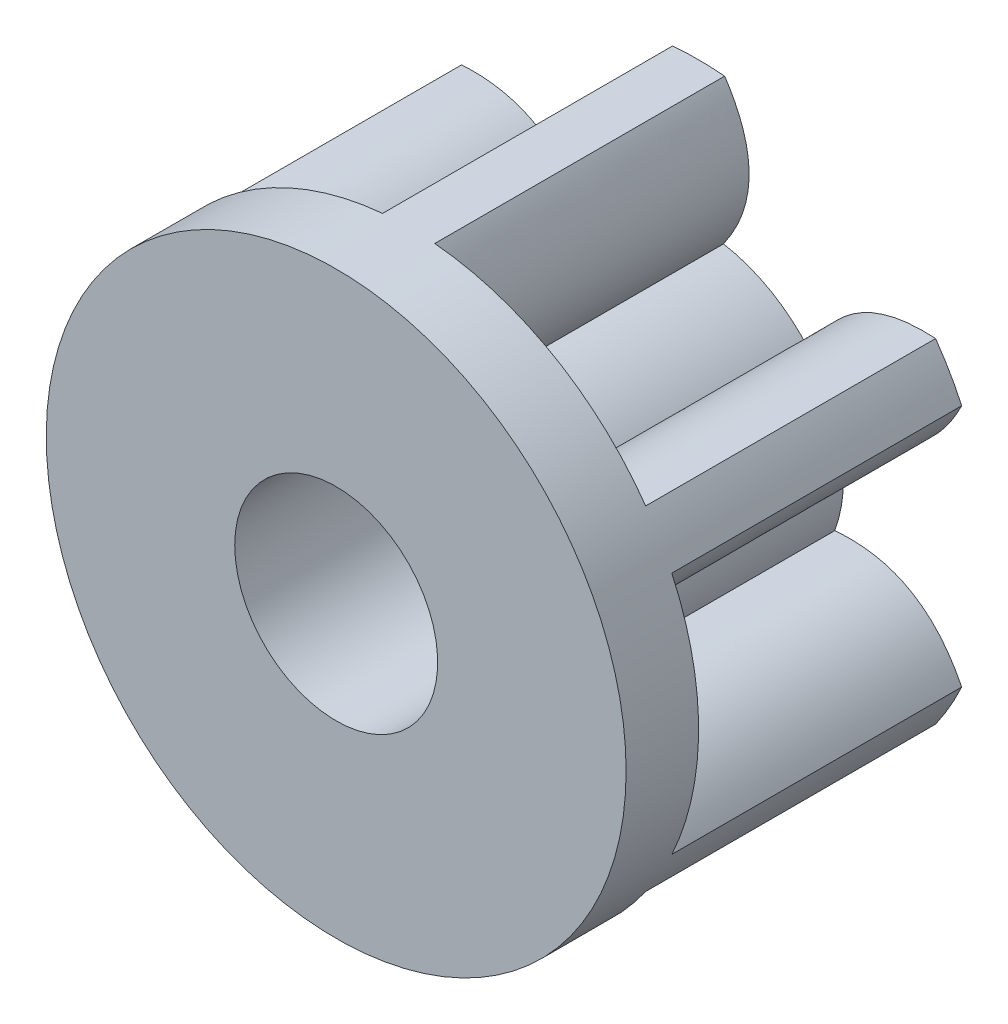
ISO-10303-21;
HEADER;
FILE_DESCRIPTION(('STEP AP214'),'2;1');
FILE_NAME('part.step','',(''),(''),'','','');
FILE_SCHEMA(('AUTOMOTIVE_DESIGN { 1 0 10303 214 1 1 1 1 }'));
ENDSEC;
DATA;
#1=APPLICATION_CONTEXT('core data for automotive mechanical design processes');
#2=APPLICATION_PROTOCOL_DEFINITION('international standard','automotive_design',2000,#1);
#3=PRODUCT_CONTEXT('',#1,'mechanical');
#4=PRODUCT('Part','Part','',(#3));
#5=PRODUCT_RELATED_PRODUCT_CATEGORY('part','',(#4));
#6=PRODUCT_DEFINITION_FORMATION('','',#4);
#7=PRODUCT_DEFINITION_CONTEXT('part definition',#1,'design');
#8=PRODUCT_DEFINITION('design','',#6,#7);
#9=PRODUCT_DEFINITION_SHAPE('','',#8);
#10=(LENGTH_UNIT() NAMED_UNIT(*) SI_UNIT(.MILLI.,.METRE.));
#11=(NAMED_UNIT(*) PLANE_ANGLE_UNIT() SI_UNIT($,.RADIAN.));
#12=(NAMED_UNIT(*) SI_UNIT($,.STERADIAN.) SOLID_ANGLE_UNIT());
#13=UNCERTAINTY_MEASURE_WITH_UNIT(LENGTH_MEASURE(1.E-05),#10,'distance_accuracy_value','');
#14=(GEOMETRIC_REPRESENTATION_CONTEXT(3) GLOBAL_UNCERTAINTY_ASSIGNED_CONTEXT((#13)) GLOBAL_UNIT_ASSIGNED_CONTEXT((#10,
#11,#12)) REPRESENTATION_CONTEXT('',''));
#15=CARTESIAN_POINT('',(0.,0.,0.));
#16=DIRECTION('',(0.,0.,1.));
#17=DIRECTION('',(1.,0.,0.));
#18=AXIS2_PLACEMENT_3D('',#15,#16,#17);
#19=CARTESIAN_POINT('',(1.63502173899346,1.15182633804702,2.));
#20=CARTESIAN_POINT('',(1.02107881373067,1.1908820937182,2.));
#21=CARTESIAN_POINT('',(0.767507810570378,0.641039593717475,2.));
#22=B_SPLINE_CURVE_WITH_KNOTS('',2,(#19,#20,#21),.UNSPECIFIED.,.F.,.F.,(3,3),(0.,1.),.UNSPECIFIED.);
#23=DIRECTION('',(0.,0.,-1.));
#24=VECTOR('',#23,1.);
#25=SURFACE_OF_LINEAR_EXTRUSION('',#22,#24);
#26=CARTESIAN_POINT('',(1.63502173899346,1.15182633804702,0.));
#27=CARTESIAN_POINT('',(1.02107881373067,1.1908820937182,0.));
#28=CARTESIAN_POINT('',(0.767507810570378,0.641039593717475,0.));
#29=B_SPLINE_CURVE_WITH_KNOTS('',2,(#26,#27,#28),.UNSPECIFIED.,.F.,.F.,(3,3),(0.,1.),.UNSPECIFIED.);
#30=CARTESIAN_POINT('',(1.63502173899346,1.15182633804702,0.));
#31=VERTEX_POINT('',#30);
#32=CARTESIAN_POINT('',(0.767507810570378,0.641039593717475,0.));
#33=VERTEX_POINT('',#32);
#34=EDGE_CURVE('E361',#31,#33,#29,.T.);
#35=ORIENTED_EDGE('',*,*,#34,.T.);
#36=DIRECTION('',(0.,0.,-1.));
#37=VECTOR('',#36,1.);
#38=CARTESIAN_POINT('',(0.767507810570378,0.641039593717475,2.));
#39=LINE('',#38,#37);
#40=CARTESIAN_POINT('',(0.767507810570378,0.641039593717475,2.));
#41=VERTEX_POINT('',#40);
#42=EDGE_CURVE('E11',#41,#33,#39,.T.);
#43=ORIENTED_EDGE('',*,*,#42,.F.);
#44=CARTESIAN_POINT('',(1.63502173899346,1.15182633804702,2.));
#45=VERTEX_POINT('',#44);
#46=EDGE_CURVE('E454',#45,#41,#22,.T.);
#47=ORIENTED_EDGE('',*,*,#46,.F.);
#48=DIRECTION('',(0.,0.,-1.));
#49=VECTOR('',#48,1.);
#50=CARTESIAN_POINT('',(1.63502173899346,1.15182633804702,2.));
#51=LINE('',#50,#49);
#52=EDGE_CURVE('E51',#45,#31,#51,.T.);
#53=ORIENTED_EDGE('',*,*,#52,.T.);
#54=EDGE_LOOP('',(#35,#43,#47,#53));
#55=FACE_BOUND('',#54,.T.);
#56=ADVANCED_FACE('F34',(#55),#25,.F.);
#57=CARTESIAN_POINT('',(0.,0.,2.));
#58=DIRECTION('',(0.,0.,-1.));
#59=DIRECTION('',(-1.,0.,0.));
#60=AXIS2_PLACEMENT_3D('',#57,#58,#59);
#61=CYLINDRICAL_SURFACE('',#60,1.);
#62=CARTESIAN_POINT('',(0.,0.,0.));
#63=DIRECTION('',(0.,0.,1.));
#64=DIRECTION('',(1.,0.,0.));
#65=AXIS2_PLACEMENT_3D('',#62,#63,#64);
#66=CIRCLE('',#65,1.);
#67=CARTESIAN_POINT('',(0.171402667705802,0.985201058415659,0.));
#68=VERTEX_POINT('',#67);
#69=EDGE_CURVE('E355',#33,#68,#66,.T.);
#70=ORIENTED_EDGE('',*,*,#69,.T.);
#71=DIRECTION('',(0.,0.,-1.));
#72=VECTOR('',#71,1.);
#73=CARTESIAN_POINT('',(0.171402667705802,0.985201058415659,2.));
#74=LINE('',#73,#72);
#75=CARTESIAN_POINT('',(0.171402667705802,0.985201058415659,2.));
#76=VERTEX_POINT('',#75);
#77=EDGE_CURVE('E43',#76,#68,#74,.T.);
#78=ORIENTED_EDGE('',*,*,#77,.F.);
#79=CARTESIAN_POINT('',(0.,0.,2.));
#80=DIRECTION('',(0.,0.,1.));
#81=DIRECTION('',(1.,0.,0.));
#82=AXIS2_PLACEMENT_3D('',#79,#80,#81);
#83=CIRCLE('',#82,1.);
#84=EDGE_CURVE('E141',#41,#76,#83,.T.);
#85=ORIENTED_EDGE('',*,*,#84,.F.);
#86=ORIENTED_EDGE('',*,*,#42,.T.);
#87=EDGE_LOOP('',(#70,#78,#85,#86));
#88=FACE_BOUND('',#87,.T.);
#89=ADVANCED_FACE('F501',(#88),#61,.T.);
#90=CARTESIAN_POINT('',(0.171402667705802,0.985201058415659,2.));
#91=CARTESIAN_POINT('',(0.520879983891172,1.47977723148367,2.));
#92=CARTESIAN_POINT('',(0.179817657642402,1.9919,2.));
#93=B_SPLINE_CURVE_WITH_KNOTS('',2,(#90,#91,#92),.UNSPECIFIED.,.F.,.F.,(3,3),(0.,1.),.UNSPECIFIED.);
#94=DIRECTION('',(0.,0.,-1.));
#95=VECTOR('',#94,1.);
#96=SURFACE_OF_LINEAR_EXTRUSION('',#93,#95);
#97=CARTESIAN_POINT('',(0.171402667705802,0.985201058415659,0.));
#98=CARTESIAN_POINT('',(0.520879983891172,1.47977723148367,0.));
#99=CARTESIAN_POINT('',(0.179817657642402,1.9919,0.));
#100=B_SPLINE_CURVE_WITH_KNOTS('',2,(#97,#98,#99),.UNSPECIFIED.,.F.,.F.,(3,3),(0.,1.),.UNSPECIFIED.);
#101=CARTESIAN_POINT('',(0.179817657642402,1.9919,0.));
#102=VERTEX_POINT('',#101);
#103=EDGE_CURVE('E348',#68,#102,#100,.T.);
#104=ORIENTED_EDGE('',*,*,#103,.T.);
#105=DIRECTION('',(0.,0.,-1.));
#106=VECTOR('',#105,1.);
#107=CARTESIAN_POINT('',(0.179817657642402,1.9919,2.));
#108=LINE('',#107,#106);
#109=CARTESIAN_POINT('',(0.179817657642402,1.9919,2.));
#110=VERTEX_POINT('',#109);
#111=EDGE_CURVE('E341',#110,#102,#108,.T.);
#112=ORIENTED_EDGE('',*,*,#111,.F.);
#113=EDGE_CURVE('E350',#76,#110,#93,.T.);
#114=ORIENTED_EDGE('',*,*,#113,.F.);
#115=ORIENTED_EDGE('',*,*,#77,.T.);
#116=EDGE_LOOP('',(#104,#112,#114,#115));
#117=FACE_BOUND('',#116,.T.);
#118=ADVANCED_FACE('F347',(#117),#96,.F.);
#119=CARTESIAN_POINT('',(-0.18,1.99188353073165,2.));
#120=CARTESIAN_POINT('',(-0.520794739206634,1.47972123881594,2.));
#121=CARTESIAN_POINT('',(-0.171402667705803,0.985201058415659,2.));
#122=B_SPLINE_CURVE_WITH_KNOTS('',2,(#119,#120,#121),.UNSPECIFIED.,.F.,.F.,(3,3),(0.,1.),.UNSPECIFIED.);
#123=DIRECTION('',(0.,0.,-1.));
#124=VECTOR('',#123,1.);
#125=SURFACE_OF_LINEAR_EXTRUSION('',#122,#124);
#126=CARTESIAN_POINT('',(-0.18,1.99188353073165,0.));
#127=CARTESIAN_POINT('',(-0.520794739206634,1.47972123881594,0.));
#128=CARTESIAN_POINT('',(-0.171402667705803,0.985201058415659,0.));
#129=B_SPLINE_CURVE_WITH_KNOTS('',2,(#126,#127,#128),.UNSPECIFIED.,.F.,.F.,(3,3),(0.,1.),.UNSPECIFIED.);
#130=CARTESIAN_POINT('',(-0.18,1.99188353073165,0.));
#131=VERTEX_POINT('',#130);
#132=CARTESIAN_POINT('',(-0.171402667705803,0.985201058415659,0.));
#133=VERTEX_POINT('',#132);
#134=EDGE_CURVE('E359',#131,#133,#129,.T.);
#135=ORIENTED_EDGE('',*,*,#134,.T.);
#136=DIRECTION('',(0.,0.,-1.));
#137=VECTOR('',#136,1.);
#138=CARTESIAN_POINT('',(-0.171402667705803,0.985201058415659,2.));
#139=LINE('',#138,#137);
#140=CARTESIAN_POINT('',(-0.171402667705803,0.985201058415659,2.));
#141=VERTEX_POINT('',#140);
#142=EDGE_CURVE('E335',#141,#133,#139,.T.);
#143=ORIENTED_EDGE('',*,*,#142,.F.);
#144=CARTESIAN_POINT('',(-0.18,1.99188353073165,2.));
#145=VERTEX_POINT('',#144);
#146=EDGE_CURVE('E518',#145,#141,#122,.T.);
#147=ORIENTED_EDGE('',*,*,#146,.F.);
#148=DIRECTION('',(0.,0.,-1.));
#149=VECTOR('',#148,1.);
#150=CARTESIAN_POINT('',(-0.18,1.99188353073165,2.));
#151=LINE('',#150,#149);
#152=EDGE_CURVE('E338',#145,#131,#151,.T.);
#153=ORIENTED_EDGE('',*,*,#152,.T.);
#154=EDGE_LOOP('',(#135,#143,#147,#153));
#155=FACE_BOUND('',#154,.T.);
#156=ADVANCED_FACE('F508',(#155),#125,.F.);
#157=CARTESIAN_POINT('',(0.,0.,2.));
#158=DIRECTION('',(0.,0.,-1.));
#159=DIRECTION('',(-1.,0.,0.));
#160=AXIS2_PLACEMENT_3D('',#157,#158,#159);
#161=CYLINDRICAL_SURFACE('',#160,1.);
#162=CARTESIAN_POINT('',(0.,0.,0.));
#163=DIRECTION('',(0.,0.,1.));
#164=DIRECTION('',(1.,0.,0.));
#165=AXIS2_PLACEMENT_3D('',#162,#163,#164);
#166=CIRCLE('',#165,1.);
#167=CARTESIAN_POINT('',(-0.767507810570369,0.641039593717486,0.));
#168=VERTEX_POINT('',#167);
#169=EDGE_CURVE('E373',#133,#168,#166,.T.);
#170=ORIENTED_EDGE('',*,*,#169,.T.);
#171=DIRECTION('',(0.,0.,-1.));
#172=VECTOR('',#171,1.);
#173=CARTESIAN_POINT('',(-0.767507810570369,0.641039593717486,2.));
#174=LINE('',#173,#172);
#175=CARTESIAN_POINT('',(-0.767507810570369,0.641039593717486,2.));
#176=VERTEX_POINT('',#175);
#177=EDGE_CURVE('E332',#176,#168,#174,.T.);
#178=ORIENTED_EDGE('',*,*,#177,.F.);
#179=CARTESIAN_POINT('',(0.,0.,2.));
#180=DIRECTION('',(0.,0.,1.));
#181=DIRECTION('',(1.,0.,0.));
#182=AXIS2_PLACEMENT_3D('',#179,#180,#181);
#183=CIRCLE('',#182,1.);
#184=EDGE_CURVE('E527',#141,#176,#183,.T.);
#185=ORIENTED_EDGE('',*,*,#184,.F.);
#186=ORIENTED_EDGE('',*,*,#142,.T.);
#187=EDGE_LOOP('',(#170,#178,#185,#186));
#188=FACE_BOUND('',#187,.T.);
#189=ADVANCED_FACE('F552',(#188),#161,.T.);
#190=CARTESIAN_POINT('',(-0.767507810570369,0.641039593717486,2.));
#191=CARTESIAN_POINT('',(-1.02108468246106,1.19098391411443,2.));
#192=CARTESIAN_POINT('',(-1.63512717297701,1.15167665956735,2.));
#193=B_SPLINE_CURVE_WITH_KNOTS('',2,(#190,#191,#192),.UNSPECIFIED.,.F.,.F.,(3,3),(0.,1.),.UNSPECIFIED.);
#194=DIRECTION('',(0.,0.,-1.));
#195=VECTOR('',#194,1.);
#196=SURFACE_OF_LINEAR_EXTRUSION('',#193,#195);
#197=CARTESIAN_POINT('',(-0.767507810570369,0.641039593717486,0.));
#198=CARTESIAN_POINT('',(-1.02108468246106,1.19098391411443,0.));
#199=CARTESIAN_POINT('',(-1.63512717297701,1.15167665956735,0.));
#200=B_SPLINE_CURVE_WITH_KNOTS('',2,(#197,#198,#199),.UNSPECIFIED.,.F.,.F.,(3,3),(0.,1.),.UNSPECIFIED.);
#201=CARTESIAN_POINT('',(-1.63512717297701,1.15167665956735,0.));
#202=VERTEX_POINT('',#201);
#203=EDGE_CURVE('E378',#168,#202,#200,.T.);
#204=ORIENTED_EDGE('',*,*,#203,.T.);
#205=DIRECTION('',(0.,0.,-1.));
#206=VECTOR('',#205,1.);
#207=CARTESIAN_POINT('',(-1.63512717297701,1.15167665956735,2.));
#208=LINE('',#207,#206);
#209=CARTESIAN_POINT('',(-1.63512717297701,1.15167665956735,2.));
#210=VERTEX_POINT('',#209);
#211=EDGE_CURVE('E329',#210,#202,#208,.T.);
#212=ORIENTED_EDGE('',*,*,#211,.F.);
#213=EDGE_CURVE('E533',#176,#210,#193,.T.);
#214=ORIENTED_EDGE('',*,*,#213,.F.);
#215=ORIENTED_EDGE('',*,*,#177,.T.);
#216=EDGE_LOOP('',(#204,#212,#214,#215));
#217=FACE_BOUND('',#216,.T.);
#218=ADVANCED_FACE('F548',(#217),#196,.F.);
#219=CARTESIAN_POINT('',(-1.81502173899344,0.840057192684649,2.));
#220=CARTESIAN_POINT('',(-1.5418735529373,0.28883914509775,2.));
#221=CARTESIAN_POINT('',(-0.938910478276174,0.344161464698193,2.));
#222=B_SPLINE_CURVE_WITH_KNOTS('',2,(#219,#220,#221),.UNSPECIFIED.,.F.,.F.,(3,3),(0.,1.),.UNSPECIFIED.);
#223=DIRECTION('',(0.,0.,-1.));
#224=VECTOR('',#223,1.);
#225=SURFACE_OF_LINEAR_EXTRUSION('',#222,#224);
#226=CARTESIAN_POINT('',(-1.81502173899344,0.840057192684649,0.));
#227=CARTESIAN_POINT('',(-1.5418735529373,0.28883914509775,0.));
#228=CARTESIAN_POINT('',(-0.938910478276174,0.344161464698193,0.));
#229=B_SPLINE_CURVE_WITH_KNOTS('',2,(#226,#227,#228),.UNSPECIFIED.,.F.,.F.,(3,3),(0.,1.),.UNSPECIFIED.);
#230=CARTESIAN_POINT('',(-1.81502173899344,0.840057192684649,0.));
#231=VERTEX_POINT('',#230);
#232=CARTESIAN_POINT('',(-0.938910478276174,0.344161464698193,0.));
#233=VERTEX_POINT('',#232);
#234=EDGE_CURVE('E387',#231,#233,#229,.T.);
#235=ORIENTED_EDGE('',*,*,#234,.T.);
#236=DIRECTION('',(0.,0.,-1.));
#237=VECTOR('',#236,1.);
#238=CARTESIAN_POINT('',(-0.938910478276174,0.344161464698193,2.));
#239=LINE('',#238,#237);
#240=CARTESIAN_POINT('',(-0.938910478276174,0.344161464698193,2.));
#241=VERTEX_POINT('',#240);
#242=EDGE_CURVE('E323',#241,#233,#239,.T.);
#243=ORIENTED_EDGE('',*,*,#242,.F.);
#244=CARTESIAN_POINT('',(-1.81502173899344,0.840057192684649,2.));
#245=VERTEX_POINT('',#244);
#246=EDGE_CURVE('E539',#245,#241,#222,.T.);
#247=ORIENTED_EDGE('',*,*,#246,.F.);
#248=DIRECTION('',(0.,0.,-1.));
#249=VECTOR('',#248,1.);
#250=CARTESIAN_POINT('',(-1.81502173899344,0.840057192684649,2.));
#251=LINE('',#250,#249);
#252=EDGE_CURVE('E326',#245,#231,#251,.T.);
#253=ORIENTED_EDGE('',*,*,#252,.T.);
#254=EDGE_LOOP('',(#235,#243,#247,#253));
#255=FACE_BOUND('',#254,.T.);
#256=ADVANCED_FACE('F551',(#255),#225,.F.);
#257=CARTESIAN_POINT('',(0.,0.,2.));
#258=DIRECTION('',(0.,0.,-1.));
#259=DIRECTION('',(-1.,0.,0.));
#260=AXIS2_PLACEMENT_3D('',#257,#258,#259);
#261=CYLINDRICAL_SURFACE('',#260,1.);
#262=CARTESIAN_POINT('',(0.,0.,0.));
#263=DIRECTION('',(0.,0.,1.));
#264=DIRECTION('',(1.,0.,0.));
#265=AXIS2_PLACEMENT_3D('',#262,#263,#264);
#266=CIRCLE('',#265,1.);
#267=CARTESIAN_POINT('',(-0.938910478276181,-0.344161464698174,0.));
#268=VERTEX_POINT('',#267);
#269=EDGE_CURVE('E391',#233,#268,#266,.T.);
#270=ORIENTED_EDGE('',*,*,#269,.T.);
#271=DIRECTION('',(0.,0.,-1.));
#272=VECTOR('',#271,1.);
#273=CARTESIAN_POINT('',(-0.938910478276181,-0.344161464698174,2.));
#274=LINE('',#273,#272);
#275=CARTESIAN_POINT('',(-0.938910478276181,-0.344161464698174,2.));
#276=VERTEX_POINT('',#275);
#277=EDGE_CURVE('E320',#276,#268,#274,.T.);
#278=ORIENTED_EDGE('',*,*,#277,.F.);
#279=CARTESIAN_POINT('',(0.,0.,2.));
#280=DIRECTION('',(0.,0.,1.));
#281=DIRECTION('',(1.,0.,0.));
#282=AXIS2_PLACEMENT_3D('',#279,#280,#281);
#283=CIRCLE('',#282,1.);
#284=EDGE_CURVE('E578',#241,#276,#283,.T.);
#285=ORIENTED_EDGE('',*,*,#284,.F.);
#286=ORIENTED_EDGE('',*,*,#242,.T.);
#287=EDGE_LOOP('',(#270,#278,#285,#286));
#288=FACE_BOUND('',#287,.T.);
#289=ADVANCED_FACE('F645',(#288),#261,.T.);
#290=CARTESIAN_POINT('',(-0.938910478276181,-0.344161464698174,2.));
#291=CARTESIAN_POINT('',(-1.54196466635225,-0.288793317369235,2.));
#292=CARTESIAN_POINT('',(-1.81494483061943,-0.84022334043265,2.));
#293=B_SPLINE_CURVE_WITH_KNOTS('',2,(#290,#291,#292),.UNSPECIFIED.,.F.,.F.,(3,3),(0.,1.),.UNSPECIFIED.);
#294=DIRECTION('',(0.,0.,-1.));
#295=VECTOR('',#294,1.);
#296=SURFACE_OF_LINEAR_EXTRUSION('',#293,#295);
#297=CARTESIAN_POINT('',(-0.938910478276181,-0.344161464698174,0.));
#298=CARTESIAN_POINT('',(-1.54196466635225,-0.288793317369235,0.));
#299=CARTESIAN_POINT('',(-1.81494483061943,-0.84022334043265,0.));
#300=B_SPLINE_CURVE_WITH_KNOTS('',2,(#297,#298,#299),.UNSPECIFIED.,.F.,.F.,(3,3),(0.,1.),.UNSPECIFIED.);
#301=CARTESIAN_POINT('',(-1.81494483061943,-0.84022334043265,0.));
#302=VERTEX_POINT('',#301);
#303=EDGE_CURVE('E396',#268,#302,#300,.T.);
#304=ORIENTED_EDGE('',*,*,#303,.T.);
#305=DIRECTION('',(0.,0.,-1.));
#306=VECTOR('',#305,1.);
#307=CARTESIAN_POINT('',(-1.81494483061943,-0.84022334043265,2.));
#308=LINE('',#307,#306);
#309=CARTESIAN_POINT('',(-1.81494483061943,-0.84022334043265,2.));
#310=VERTEX_POINT('',#309);
#311=EDGE_CURVE('E317',#310,#302,#308,.T.);
#312=ORIENTED_EDGE('',*,*,#311,.F.);
#313=EDGE_CURVE('E583',#276,#310,#293,.T.);
#314=ORIENTED_EDGE('',*,*,#313,.F.);
#315=ORIENTED_EDGE('',*,*,#277,.T.);
#316=EDGE_LOOP('',(#304,#312,#314,#315));
#317=FACE_BOUND('',#316,.T.);
#318=ADVANCED_FACE('F643',(#317),#296,.F.);
#319=CARTESIAN_POINT('',(-1.63502173899346,-1.15182633804701,2.));
#320=CARTESIAN_POINT('',(-1.02107881373068,-1.1908820937182,2.));
#321=CARTESIAN_POINT('',(-0.767507810570382,-0.64103959371747,2.));
#322=B_SPLINE_CURVE_WITH_KNOTS('',2,(#319,#320,#321),.UNSPECIFIED.,.F.,.F.,(3,3),(0.,1.),.UNSPECIFIED.);
#323=DIRECTION('',(0.,0.,-1.));
#324=VECTOR('',#323,1.);
#325=SURFACE_OF_LINEAR_EXTRUSION('',#322,#324);
#326=CARTESIAN_POINT('',(-1.63502173899346,-1.15182633804701,0.));
#327=CARTESIAN_POINT('',(-1.02107881373068,-1.1908820937182,0.));
#328=CARTESIAN_POINT('',(-0.767507810570382,-0.64103959371747,0.));
#329=B_SPLINE_CURVE_WITH_KNOTS('',2,(#326,#327,#328),.UNSPECIFIED.,.F.,.F.,(3,3),(0.,1.),.UNSPECIFIED.);
#330=CARTESIAN_POINT('',(-1.63502173899346,-1.15182633804701,0.));
#331=VERTEX_POINT('',#330);
#332=CARTESIAN_POINT('',(-0.767507810570382,-0.64103959371747,0.));
#333=VERTEX_POINT('',#332);
#334=EDGE_CURVE('E405',#331,#333,#329,.T.);
#335=ORIENTED_EDGE('',*,*,#334,.T.);
#336=DIRECTION('',(0.,0.,-1.));
#337=VECTOR('',#336,1.);
#338=CARTESIAN_POINT('',(-0.767507810570382,-0.64103959371747,2.));
#339=LINE('',#338,#337);
#340=CARTESIAN_POINT('',(-0.767507810570382,-0.64103959371747,2.));
#341=VERTEX_POINT('',#340);
#342=EDGE_CURVE('E311',#341,#333,#339,.T.);
#343=ORIENTED_EDGE('',*,*,#342,.F.);
#344=CARTESIAN_POINT('',(-1.63502173899346,-1.15182633804701,2.));
#345=VERTEX_POINT('',#344);
#346=EDGE_CURVE('E619',#345,#341,#322,.T.);
#347=ORIENTED_EDGE('',*,*,#346,.F.);
#348=DIRECTION('',(0.,0.,-1.));
#349=VECTOR('',#348,1.);
#350=CARTESIAN_POINT('',(-1.63502173899346,-1.15182633804701,2.));
#351=LINE('',#350,#349);
#352=EDGE_CURVE('E314',#345,#331,#351,.T.);
#353=ORIENTED_EDGE('',*,*,#352,.T.);
#354=EDGE_LOOP('',(#335,#343,#347,#353));
#355=FACE_BOUND('',#354,.T.);
#356=ADVANCED_FACE('F625',(#355),#325,.F.);
#357=CARTESIAN_POINT('',(0.,0.,2.));
#358=DIRECTION('',(0.,0.,-1.));
#359=DIRECTION('',(-1.,0.,0.));
#360=AXIS2_PLACEMENT_3D('',#357,#358,#359);
#361=CYLINDRICAL_SURFACE('',#360,1.);
#362=CARTESIAN_POINT('',(0.,0.,0.));
#363=DIRECTION('',(0.,0.,1.));
#364=DIRECTION('',(1.,0.,0.));
#365=AXIS2_PLACEMENT_3D('',#362,#363,#364);
#366=CIRCLE('',#365,1.);
#367=CARTESIAN_POINT('',(-0.171402667705809,-0.985201058415658,0.));
#368=VERTEX_POINT('',#367);
#369=EDGE_CURVE('E409',#333,#368,#366,.T.);
#370=ORIENTED_EDGE('',*,*,#369,.T.);
#371=DIRECTION('',(0.,0.,-1.));
#372=VECTOR('',#371,1.);
#373=CARTESIAN_POINT('',(-0.171402667705809,-0.985201058415658,2.));
#374=LINE('',#373,#372);
#375=CARTESIAN_POINT('',(-0.171402667705809,-0.985201058415658,2.));
#376=VERTEX_POINT('',#375);
#377=EDGE_CURVE('E308',#376,#368,#374,.T.);
#378=ORIENTED_EDGE('',*,*,#377,.F.);
#379=CARTESIAN_POINT('',(0.,0.,2.));
#380=DIRECTION('',(0.,0.,1.));
#381=DIRECTION('',(1.,0.,0.));
#382=AXIS2_PLACEMENT_3D('',#379,#380,#381);
#383=CIRCLE('',#382,1.);
#384=EDGE_CURVE('E627',#341,#376,#383,.T.);
#385=ORIENTED_EDGE('',*,*,#384,.F.);
#386=ORIENTED_EDGE('',*,*,#342,.T.);
#387=EDGE_LOOP('',(#370,#378,#385,#386));
#388=FACE_BOUND('',#387,.T.);
#389=ADVANCED_FACE('F642',(#388),#361,.T.);
#390=CARTESIAN_POINT('',(-0.171402667705809,-0.985201058415658,2.));
#391=CARTESIAN_POINT('',(-0.520879983891183,-1.47977723148366,2.));
#392=CARTESIAN_POINT('',(-0.179817657642416,-1.9919,2.));
#393=B_SPLINE_CURVE_WITH_KNOTS('',2,(#390,#391,#392),.UNSPECIFIED.,.F.,.F.,(3,3),(0.,1.),.UNSPECIFIED.);
#394=DIRECTION('',(0.,0.,-1.));
#395=VECTOR('',#394,1.);
#396=SURFACE_OF_LINEAR_EXTRUSION('',#393,#395);
#397=CARTESIAN_POINT('',(-0.171402667705809,-0.985201058415658,0.));
#398=CARTESIAN_POINT('',(-0.520879983891183,-1.47977723148366,0.));
#399=CARTESIAN_POINT('',(-0.179817657642416,-1.9919,0.));
#400=B_SPLINE_CURVE_WITH_KNOTS('',2,(#397,#398,#399),.UNSPECIFIED.,.F.,.F.,(3,3),(0.,1.),.UNSPECIFIED.);
#401=CARTESIAN_POINT('',(-0.179817657642416,-1.9919,0.));
#402=VERTEX_POINT('',#401);
#403=EDGE_CURVE('E414',#368,#402,#400,.T.);
#404=ORIENTED_EDGE('',*,*,#403,.T.);
#405=DIRECTION('',(0.,0.,-1.));
#406=VECTOR('',#405,1.);
#407=CARTESIAN_POINT('',(-0.179817657642416,-1.9919,2.));
#408=LINE('',#407,#406);
#409=CARTESIAN_POINT('',(-0.179817657642416,-1.9919,2.));
#410=VERTEX_POINT('',#409);
#411=EDGE_CURVE('E305',#410,#402,#408,.T.);
#412=ORIENTED_EDGE('',*,*,#411,.F.);
#413=EDGE_CURVE('E270',#376,#410,#393,.T.);
#414=ORIENTED_EDGE('',*,*,#413,.F.);
#415=ORIENTED_EDGE('',*,*,#377,.T.);
#416=EDGE_LOOP('',(#404,#412,#414,#415));
#417=FACE_BOUND('',#416,.T.);
#418=ADVANCED_FACE('F261',(#417),#396,.F.);
#419=CARTESIAN_POINT('',(0.179999999999986,-1.99188353073166,2.));
#420=CARTESIAN_POINT('',(0.520794739206624,-1.47972123881594,2.));
#421=CARTESIAN_POINT('',(0.171402667705796,-0.98520105841566,2.));
#422=B_SPLINE_CURVE_WITH_KNOTS('',2,(#419,#420,#421),.UNSPECIFIED.,.F.,.F.,(3,3),(0.,1.),.UNSPECIFIED.);
#423=DIRECTION('',(0.,0.,-1.));
#424=VECTOR('',#423,1.);
#425=SURFACE_OF_LINEAR_EXTRUSION('',#422,#424);
#426=CARTESIAN_POINT('',(0.179999999999986,-1.99188353073166,0.));
#427=CARTESIAN_POINT('',(0.520794739206624,-1.47972123881594,0.));
#428=CARTESIAN_POINT('',(0.171402667705796,-0.98520105841566,0.));
#429=B_SPLINE_CURVE_WITH_KNOTS('',2,(#426,#427,#428),.UNSPECIFIED.,.F.,.F.,(3,3),(0.,1.),.UNSPECIFIED.);
#430=CARTESIAN_POINT('',(0.179999999999986,-1.99188353073166,0.));
#431=VERTEX_POINT('',#430);
#432=CARTESIAN_POINT('',(0.171402667705796,-0.98520105841566,0.));
#433=VERTEX_POINT('',#432);
#434=EDGE_CURVE('E423',#431,#433,#429,.T.);
#435=ORIENTED_EDGE('',*,*,#434,.T.);
#436=DIRECTION('',(0.,0.,-1.));
#437=VECTOR('',#436,1.);
#438=CARTESIAN_POINT('',(0.171402667705796,-0.98520105841566,2.));
#439=LINE('',#438,#437);
#440=CARTESIAN_POINT('',(0.171402667705796,-0.98520105841566,2.));
#441=VERTEX_POINT('',#440);
#442=EDGE_CURVE('E287',#441,#433,#439,.T.);
#443=ORIENTED_EDGE('',*,*,#442,.F.);
#444=CARTESIAN_POINT('',(0.179999999999986,-1.99188353073166,2.));
#445=VERTEX_POINT('',#444);
#446=EDGE_CURVE('E265',#445,#441,#422,.T.);
#447=ORIENTED_EDGE('',*,*,#446,.F.);
#448=DIRECTION('',(0.,0.,-1.));
#449=VECTOR('',#448,1.);
#450=CARTESIAN_POINT('',(0.179999999999986,-1.99188353073166,2.));
#451=LINE('',#450,#449);
#452=EDGE_CURVE('E302',#445,#431,#451,.T.);
#453=ORIENTED_EDGE('',*,*,#452,.T.);
#454=EDGE_LOOP('',(#435,#443,#447,#453));
#455=FACE_BOUND('',#454,.T.);
#456=ADVANCED_FACE('F256',(#455),#425,.F.);
#457=CARTESIAN_POINT('',(0.,0.,2.));
#458=DIRECTION('',(0.,0.,-1.));
#459=DIRECTION('',(-1.,0.,0.));
#460=AXIS2_PLACEMENT_3D('',#457,#458,#459);
#461=CYLINDRICAL_SURFACE('',#460,1.);
#462=CARTESIAN_POINT('',(0.,0.,0.));
#463=DIRECTION('',(0.,0.,1.));
#464=DIRECTION('',(1.,0.,0.));
#465=AXIS2_PLACEMENT_3D('',#462,#463,#464);
#466=CIRCLE('',#465,1.);
#467=CARTESIAN_POINT('',(0.767507810570373,-0.64103959371748,0.));
#468=VERTEX_POINT('',#467);
#469=EDGE_CURVE('E291',#433,#468,#466,.T.);
#470=ORIENTED_EDGE('',*,*,#469,.T.);
#471=DIRECTION('',(0.,0.,-1.));
#472=VECTOR('',#471,1.);
#473=CARTESIAN_POINT('',(0.767507810570373,-0.64103959371748,2.));
#474=LINE('',#473,#472);
#475=CARTESIAN_POINT('',(0.767507810570373,-0.64103959371748,2.));
#476=VERTEX_POINT('',#475);
#477=EDGE_CURVE('E290',#476,#468,#474,.T.);
#478=ORIENTED_EDGE('',*,*,#477,.F.);
#479=CARTESIAN_POINT('',(0.,0.,2.));
#480=DIRECTION('',(0.,0.,1.));
#481=DIRECTION('',(1.,0.,0.));
#482=AXIS2_PLACEMENT_3D('',#479,#480,#481);
#483=CIRCLE('',#482,1.);
#484=EDGE_CURVE('E231',#441,#476,#483,.T.);
#485=ORIENTED_EDGE('',*,*,#484,.F.);
#486=ORIENTED_EDGE('',*,*,#442,.T.);
#487=EDGE_LOOP('',(#470,#478,#485,#486));
#488=FACE_BOUND('',#487,.T.);
#489=ADVANCED_FACE('F252',(#488),#461,.T.);
#490=CARTESIAN_POINT('',(0.767507810570373,-0.64103959371748,2.));
#491=CARTESIAN_POINT('',(1.02108468246107,-1.19098391411442,2.));
#492=CARTESIAN_POINT('',(1.63512717297702,-1.15167665956734,2.));
#493=B_SPLINE_CURVE_WITH_KNOTS('',2,(#490,#491,#492),.UNSPECIFIED.,.F.,.F.,(3,3),(0.,1.),.UNSPECIFIED.);
#494=DIRECTION('',(0.,0.,-1.));
#495=VECTOR('',#494,1.);
#496=SURFACE_OF_LINEAR_EXTRUSION('',#493,#495);
#497=CARTESIAN_POINT('',(0.767507810570373,-0.64103959371748,0.));
#498=CARTESIAN_POINT('',(1.02108468246107,-1.19098391411442,0.));
#499=CARTESIAN_POINT('',(1.63512717297702,-1.15167665956734,0.));
#500=B_SPLINE_CURVE_WITH_KNOTS('',2,(#497,#498,#499),.UNSPECIFIED.,.F.,.F.,(3,3),(0.,1.),.UNSPECIFIED.);
#501=CARTESIAN_POINT('',(1.63512717297702,-1.15167665956734,0.));
#502=VERTEX_POINT('',#501);
#503=EDGE_CURVE('E296',#468,#502,#500,.T.);
#504=ORIENTED_EDGE('',*,*,#503,.T.);
#505=DIRECTION('',(0.,0.,-1.));
#506=VECTOR('',#505,1.);
#507=CARTESIAN_POINT('',(1.63512717297702,-1.15167665956734,2.));
#508=LINE('',#507,#506);
#509=CARTESIAN_POINT('',(1.63512717297702,-1.15167665956734,2.));
#510=VERTEX_POINT('',#509);
#511=EDGE_CURVE('E293',#510,#502,#508,.T.);
#512=ORIENTED_EDGE('',*,*,#511,.F.);
#513=EDGE_CURVE('E228',#476,#510,#493,.T.);
#514=ORIENTED_EDGE('',*,*,#513,.F.);
#515=ORIENTED_EDGE('',*,*,#477,.T.);
#516=EDGE_LOOP('',(#504,#512,#514,#515));
#517=FACE_BOUND('',#516,.T.);
#518=ADVANCED_FACE('F248',(#517),#496,.F.);
#519=CARTESIAN_POINT('',(1.81502173899345,-0.840057192684637,2.));
#520=CARTESIAN_POINT('',(1.5418735529373,-0.288839145097739,2.));
#521=CARTESIAN_POINT('',(0.938910478276177,-0.344161464698186,2.));
#522=B_SPLINE_CURVE_WITH_KNOTS('',2,(#519,#520,#521),.UNSPECIFIED.,.F.,.F.,(3,3),(0.,1.),.UNSPECIFIED.);
#523=DIRECTION('',(0.,0.,-1.));
#524=VECTOR('',#523,1.);
#525=SURFACE_OF_LINEAR_EXTRUSION('',#522,#524);
#526=CARTESIAN_POINT('',(1.81502173899345,-0.840057192684637,0.));
#527=CARTESIAN_POINT('',(1.5418735529373,-0.288839145097739,0.));
#528=CARTESIAN_POINT('',(0.938910478276177,-0.344161464698186,0.));
#529=B_SPLINE_CURVE_WITH_KNOTS('',2,(#526,#527,#528),.UNSPECIFIED.,.F.,.F.,(3,3),(0.,1.),.UNSPECIFIED.);
#530=CARTESIAN_POINT('',(1.81502173899345,-0.840057192684637,0.));
#531=VERTEX_POINT('',#530);
#532=CARTESIAN_POINT('',(0.938910478276177,-0.344161464698186,0.));
#533=VERTEX_POINT('',#532);
#534=EDGE_CURVE('E211',#531,#533,#529,.T.);
#535=ORIENTED_EDGE('',*,*,#534,.T.);
#536=DIRECTION('',(0.,0.,-1.));
#537=VECTOR('',#536,1.);
#538=CARTESIAN_POINT('',(0.938910478276177,-0.344161464698186,2.));
#539=LINE('',#538,#537);
#540=CARTESIAN_POINT('',(0.938910478276177,-0.344161464698186,2.));
#541=VERTEX_POINT('',#540);
#542=EDGE_CURVE('E203',#541,#533,#539,.T.);
#543=ORIENTED_EDGE('',*,*,#542,.F.);
#544=CARTESIAN_POINT('',(1.81502173899345,-0.840057192684637,2.));
#545=VERTEX_POINT('',#544);
#546=EDGE_CURVE('E208',#545,#541,#522,.T.);
#547=ORIENTED_EDGE('',*,*,#546,.F.);
#548=DIRECTION('',(0.,0.,-1.));
#549=VECTOR('',#548,1.);
#550=CARTESIAN_POINT('',(1.81502173899345,-0.840057192684637,2.));
#551=LINE('',#550,#549);
#552=EDGE_CURVE('E214',#545,#531,#551,.T.);
#553=ORIENTED_EDGE('',*,*,#552,.T.);
#554=EDGE_LOOP('',(#535,#543,#547,#553));
#555=FACE_BOUND('',#554,.T.);
#556=ADVANCED_FACE('F205',(#555),#525,.F.);
#557=CARTESIAN_POINT('',(0.,0.,2.));
#558=DIRECTION('',(0.,0.,-1.));
#559=DIRECTION('',(-1.,0.,0.));
#560=AXIS2_PLACEMENT_3D('',#557,#558,#559);
#561=CYLINDRICAL_SURFACE('',#560,1.);
#562=CARTESIAN_POINT('',(0.,0.,0.));
#563=DIRECTION('',(0.,0.,1.));
#564=DIRECTION('',(1.,0.,0.));
#565=AXIS2_PLACEMENT_3D('',#562,#563,#564);
#566=CIRCLE('',#565,1.);
#567=CARTESIAN_POINT('',(0.938910478276179,0.34416146469818,0.));
#568=VERTEX_POINT('',#567);
#569=EDGE_CURVE('E442',#533,#568,#566,.T.);
#570=ORIENTED_EDGE('',*,*,#569,.T.);
#571=DIRECTION('',(0.,0.,-1.));
#572=VECTOR('',#571,1.);
#573=CARTESIAN_POINT('',(0.938910478276179,0.34416146469818,2.));
#574=LINE('',#573,#572);
#575=CARTESIAN_POINT('',(0.938910478276179,0.34416146469818,2.));
#576=VERTEX_POINT('',#575);
#577=EDGE_CURVE('E215',#576,#568,#574,.T.);
#578=ORIENTED_EDGE('',*,*,#577,.F.);
#579=CARTESIAN_POINT('',(0.,0.,2.));
#580=DIRECTION('',(0.,0.,1.));
#581=DIRECTION('',(1.,0.,0.));
#582=AXIS2_PLACEMENT_3D('',#579,#580,#581);
#583=CIRCLE('',#582,1.);
#584=EDGE_CURVE('E218',#541,#576,#583,.T.);
#585=ORIENTED_EDGE('',*,*,#584,.F.);
#586=ORIENTED_EDGE('',*,*,#542,.T.);
#587=EDGE_LOOP('',(#570,#578,#585,#586));
#588=FACE_BOUND('',#587,.T.);
#589=ADVANCED_FACE('F219',(#588),#561,.T.);
#590=CARTESIAN_POINT('',(0.938910478276179,0.34416146469818,2.));
#591=CARTESIAN_POINT('',(1.54196466635225,0.288793317369246,2.));
#592=CARTESIAN_POINT('',(1.81494483061943,0.840223340432663,2.));
#593=B_SPLINE_CURVE_WITH_KNOTS('',2,(#590,#591,#592),.UNSPECIFIED.,.F.,.F.,(3,3),(0.,1.),.UNSPECIFIED.);
#594=DIRECTION('',(0.,0.,-1.));
#595=VECTOR('',#594,1.);
#596=SURFACE_OF_LINEAR_EXTRUSION('',#593,#595);
#597=CARTESIAN_POINT('',(0.938910478276179,0.34416146469818,0.));
#598=CARTESIAN_POINT('',(1.54196466635225,0.288793317369246,0.));
#599=CARTESIAN_POINT('',(1.81494483061943,0.840223340432663,0.));
#600=B_SPLINE_CURVE_WITH_KNOTS('',2,(#597,#598,#599),.UNSPECIFIED.,.F.,.F.,(3,3),(0.,1.),.UNSPECIFIED.);
#601=CARTESIAN_POINT('',(1.81494483061943,0.840223340432663,0.));
#602=VERTEX_POINT('',#601);
#603=EDGE_CURVE('E130',#568,#602,#600,.T.);
#604=ORIENTED_EDGE('',*,*,#603,.T.);
#605=DIRECTION('',(0.,0.,-1.));
#606=VECTOR('',#605,1.);
#607=CARTESIAN_POINT('',(1.81494483061943,0.840223340432663,2.));
#608=LINE('',#607,#606);
#609=CARTESIAN_POINT('',(1.81494483061943,0.840223340432663,2.));
#610=VERTEX_POINT('',#609);
#611=EDGE_CURVE('E456',#610,#602,#608,.T.);
#612=ORIENTED_EDGE('',*,*,#611,.F.);
#613=EDGE_CURVE('E223',#576,#610,#593,.T.);
#614=ORIENTED_EDGE('',*,*,#613,.F.);
#615=ORIENTED_EDGE('',*,*,#577,.T.);
#616=EDGE_LOOP('',(#604,#612,#614,#615));
#617=FACE_BOUND('',#616,.T.);
#618=ADVANCED_FACE('F458',(#617),#596,.F.);
#619=CARTESIAN_POINT('',(0.,0.,2.));
#620=DIRECTION('',(0.,0.,-1.));
#621=DIRECTION('',(-1.,0.,0.));
#622=AXIS2_PLACEMENT_3D('',#619,#620,#621);
#623=CYLINDRICAL_SURFACE('',#622,2.);
#624=CARTESIAN_POINT('',(0.,0.,0.));
#625=DIRECTION('',(0.,0.,1.));
#626=DIRECTION('',(1.,0.,0.));
#627=AXIS2_PLACEMENT_3D('',#624,#625,#626);
#628=CIRCLE('',#627,2.);
#629=EDGE_CURVE('E134',#602,#31,#628,.T.);
#630=ORIENTED_EDGE('',*,*,#629,.T.);
#631=ORIENTED_EDGE('',*,*,#52,.F.);
#632=CARTESIAN_POINT('',(0.,0.,2.));
#633=DIRECTION('',(0.,0.,1.));
#634=DIRECTION('',(1.,0.,0.));
#635=AXIS2_PLACEMENT_3D('',#632,#633,#634);
#636=CIRCLE('',#635,2.);
#637=EDGE_CURVE('E463',#45,#110,#636,.T.);
#638=ORIENTED_EDGE('',*,*,#637,.T.);
#639=ORIENTED_EDGE('',*,*,#111,.T.);
#640=CARTESIAN_POINT('',(0.,0.,0.));
#641=DIRECTION('',(0.,0.,1.));
#642=DIRECTION('',(1.,0.,0.));
#643=AXIS2_PLACEMENT_3D('',#640,#641,#642);
#644=CIRCLE('',#643,2.);
#645=EDGE_CURVE('E357',#102,#131,#644,.T.);
#646=ORIENTED_EDGE('',*,*,#645,.T.);
#647=ORIENTED_EDGE('',*,*,#152,.F.);
#648=EDGE_CURVE('E584',#145,#210,#636,.T.);
#649=ORIENTED_EDGE('',*,*,#648,.T.);
#650=ORIENTED_EDGE('',*,*,#211,.T.);
#651=CARTESIAN_POINT('',(0.,0.,0.));
#652=DIRECTION('',(0.,0.,1.));
#653=DIRECTION('',(1.,0.,0.));
#654=AXIS2_PLACEMENT_3D('',#651,#652,#653);
#655=CIRCLE('',#654,2.);
#656=EDGE_CURVE('E382',#202,#231,#655,.T.);
#657=ORIENTED_EDGE('',*,*,#656,.T.);
#658=ORIENTED_EDGE('',*,*,#252,.F.);
#659=EDGE_CURVE('E580',#245,#310,#636,.T.);
#660=ORIENTED_EDGE('',*,*,#659,.T.);
#661=ORIENTED_EDGE('',*,*,#311,.T.);
#662=CARTESIAN_POINT('',(0.,0.,0.));
#663=DIRECTION('',(0.,0.,1.));
#664=DIRECTION('',(1.,0.,0.));
#665=AXIS2_PLACEMENT_3D('',#662,#663,#664);
#666=CIRCLE('',#665,2.);
#667=EDGE_CURVE('E400',#302,#331,#666,.T.);
#668=ORIENTED_EDGE('',*,*,#667,.T.);
#669=ORIENTED_EDGE('',*,*,#352,.F.);
#670=EDGE_CURVE('E585',#345,#410,#636,.T.);
#671=ORIENTED_EDGE('',*,*,#670,.T.);
#672=ORIENTED_EDGE('',*,*,#411,.T.);
#673=CARTESIAN_POINT('',(0.,0.,0.));
#674=DIRECTION('',(0.,0.,1.));
#675=DIRECTION('',(1.,0.,0.));
#676=AXIS2_PLACEMENT_3D('',#673,#674,#675);
#677=CIRCLE('',#676,2.);
#678=EDGE_CURVE('E418',#402,#431,#677,.T.);
#679=ORIENTED_EDGE('',*,*,#678,.T.);
#680=ORIENTED_EDGE('',*,*,#452,.F.);
#681=EDGE_CURVE('E588',#445,#510,#636,.T.);
#682=ORIENTED_EDGE('',*,*,#681,.T.);
#683=ORIENTED_EDGE('',*,*,#511,.T.);
#684=CARTESIAN_POINT('',(0.,0.,0.));
#685=DIRECTION('',(0.,0.,1.));
#686=DIRECTION('',(1.,0.,0.));
#687=AXIS2_PLACEMENT_3D('',#684,#685,#686);
#688=CIRCLE('',#687,2.);
#689=EDGE_CURVE('E434',#502,#531,#688,.T.);
#690=ORIENTED_EDGE('',*,*,#689,.T.);
#691=ORIENTED_EDGE('',*,*,#552,.F.);
#692=EDGE_CURVE('E227',#545,#610,#636,.T.);
#693=ORIENTED_EDGE('',*,*,#692,.T.);
#694=ORIENTED_EDGE('',*,*,#611,.T.);
#695=EDGE_LOOP('',(#630,#631,#638,#639,#646,#647,#649,#650,#657,#658,#660,#661,#668,#669,#671,
#672,#679,#680,#682,#683,#690,#691,#693,#694));
#696=FACE_BOUND('',#695,.T.);
#697=CARTESIAN_POINT('',(0.,0.,2.5));
#698=DIRECTION('',(0.,0.,1.));
#699=DIRECTION('',(1.,0.,0.));
#700=AXIS2_PLACEMENT_3D('',#697,#698,#699);
#701=CIRCLE('',#700,2.);
#702=CARTESIAN_POINT('',(2.,0.,2.5));
#703=VERTEX_POINT('',#702);
#704=EDGE_CURVE('E461',#703,#703,#701,.T.);
#705=ORIENTED_EDGE('',*,*,#704,.F.);
#706=EDGE_LOOP('',(#705));
#707=FACE_BOUND('',#706,.T.);
#708=ADVANCED_FACE('F478',(#696,#707),#623,.T.);
#709=CARTESIAN_POINT('',(1.11117179425629,1.04365752980023,0.));
#710=DIRECTION('',(0.,0.,-1.));
#711=DIRECTION('',(-1.,0.,0.));
#712=AXIS2_PLACEMENT_3D('',#709,#710,#711);
#713=PLANE('',#712);
#714=CARTESIAN_POINT('',(0.,0.,0.));
#715=DIRECTION('',(0.,0.,-1.));
#716=DIRECTION('',(-1.,0.,0.));
#717=AXIS2_PLACEMENT_3D('',#714,#715,#716);
#718=CIRCLE('',#717,0.7);
#719=CARTESIAN_POINT('',(-0.7,0.,0.));
#720=VERTEX_POINT('',#719);
#721=EDGE_CURVE('E835',#720,#720,#718,.T.);
#722=ORIENTED_EDGE('',*,*,#721,.F.);
#723=EDGE_LOOP('',(#722));
#724=FACE_BOUND('',#723,.T.);
#725=ORIENTED_EDGE('',*,*,#34,.F.);
#726=ORIENTED_EDGE('',*,*,#629,.F.);
#727=ORIENTED_EDGE('',*,*,#603,.F.);
#728=ORIENTED_EDGE('',*,*,#569,.F.);
#729=ORIENTED_EDGE('',*,*,#534,.F.);
#730=ORIENTED_EDGE('',*,*,#689,.F.);
#731=ORIENTED_EDGE('',*,*,#503,.F.);
#732=ORIENTED_EDGE('',*,*,#469,.F.);
#733=ORIENTED_EDGE('',*,*,#434,.F.);
#734=ORIENTED_EDGE('',*,*,#678,.F.);
#735=ORIENTED_EDGE('',*,*,#403,.F.);
#736=ORIENTED_EDGE('',*,*,#369,.F.);
#737=ORIENTED_EDGE('',*,*,#334,.F.);
#738=ORIENTED_EDGE('',*,*,#667,.F.);
#739=ORIENTED_EDGE('',*,*,#303,.F.);
#740=ORIENTED_EDGE('',*,*,#269,.F.);
#741=ORIENTED_EDGE('',*,*,#234,.F.);
#742=ORIENTED_EDGE('',*,*,#656,.F.);
#743=ORIENTED_EDGE('',*,*,#203,.F.);
#744=ORIENTED_EDGE('',*,*,#169,.F.);
#745=ORIENTED_EDGE('',*,*,#134,.F.);
#746=ORIENTED_EDGE('',*,*,#645,.F.);
#747=ORIENTED_EDGE('',*,*,#103,.F.);
#748=ORIENTED_EDGE('',*,*,#69,.F.);
#749=EDGE_LOOP('',(#725,#726,#727,#728,#729,#730,#731,#732,#733,#734,#735,#736,#737,#738,#739,
#740,#741,#742,#743,#744,#745,#746,#747,#748));
#750=FACE_BOUND('',#749,.T.);
#751=ADVANCED_FACE('F354',(#724,#750),#713,.T.);
#752=CARTESIAN_POINT('',(0.,0.,2.));
#753=DIRECTION('',(0.,0.,1.));
#754=DIRECTION('',(1.,0.,0.));
#755=AXIS2_PLACEMENT_3D('',#752,#753,#754);
#756=PLANE('',#755);
#757=ORIENTED_EDGE('',*,*,#637,.F.);
#758=ORIENTED_EDGE('',*,*,#46,.T.);
#759=ORIENTED_EDGE('',*,*,#84,.T.);
#760=ORIENTED_EDGE('',*,*,#113,.T.);
#761=EDGE_LOOP('',(#757,#758,#759,#760));
#762=FACE_BOUND('',#761,.T.);
#763=ADVANCED_FACE('F483',(#762),#756,.F.);
#764=ORIENTED_EDGE('',*,*,#648,.F.);
#765=ORIENTED_EDGE('',*,*,#146,.T.);
#766=ORIENTED_EDGE('',*,*,#184,.T.);
#767=ORIENTED_EDGE('',*,*,#213,.T.);
#768=EDGE_LOOP('',(#764,#765,#766,#767));
#769=FACE_BOUND('',#768,.T.);
#770=ADVANCED_FACE('F487',(#769),#756,.F.);
#771=ORIENTED_EDGE('',*,*,#659,.F.);
#772=ORIENTED_EDGE('',*,*,#246,.T.);
#773=ORIENTED_EDGE('',*,*,#284,.T.);
#774=ORIENTED_EDGE('',*,*,#313,.T.);
#775=EDGE_LOOP('',(#771,#772,#773,#774));
#776=FACE_BOUND('',#775,.T.);
#777=ADVANCED_FACE('F581',(#776),#756,.F.);
#778=ORIENTED_EDGE('',*,*,#670,.F.);
#779=ORIENTED_EDGE('',*,*,#346,.T.);
#780=ORIENTED_EDGE('',*,*,#384,.T.);
#781=ORIENTED_EDGE('',*,*,#413,.T.);
#782=EDGE_LOOP('',(#778,#779,#780,#781));
#783=FACE_BOUND('',#782,.T.);
#784=ADVANCED_FACE('F606',(#783),#756,.F.);
#785=ORIENTED_EDGE('',*,*,#681,.F.);
#786=ORIENTED_EDGE('',*,*,#446,.T.);
#787=ORIENTED_EDGE('',*,*,#484,.T.);
#788=ORIENTED_EDGE('',*,*,#513,.T.);
#789=EDGE_LOOP('',(#785,#786,#787,#788));
#790=FACE_BOUND('',#789,.T.);
#791=ADVANCED_FACE('F282',(#790),#756,.F.);
#792=ORIENTED_EDGE('',*,*,#692,.F.);
#793=ORIENTED_EDGE('',*,*,#546,.T.);
#794=ORIENTED_EDGE('',*,*,#584,.T.);
#795=ORIENTED_EDGE('',*,*,#613,.T.);
#796=EDGE_LOOP('',(#792,#793,#794,#795));
#797=FACE_BOUND('',#796,.T.);
#798=ADVANCED_FACE('F225',(#797),#756,.F.);
#799=CARTESIAN_POINT('',(0.,0.,2.5));
#800=DIRECTION('',(0.,0.,1.));
#801=DIRECTION('',(1.,0.,0.));
#802=AXIS2_PLACEMENT_3D('',#799,#800,#801);
#803=PLANE('',#802);
#804=CARTESIAN_POINT('',(0.,0.,2.5));
#805=DIRECTION('',(0.,0.,-1.));
#806=DIRECTION('',(-1.,0.,0.));
#807=AXIS2_PLACEMENT_3D('',#804,#805,#806);
#808=CIRCLE('',#807,0.7);
#809=CARTESIAN_POINT('',(-0.7,0.,2.5));
#810=VERTEX_POINT('',#809);
#811=EDGE_CURVE('E589',#810,#810,#808,.T.);
#812=ORIENTED_EDGE('',*,*,#811,.T.);
#813=EDGE_LOOP('',(#812));
#814=FACE_BOUND('',#813,.T.);
#815=ORIENTED_EDGE('',*,*,#704,.T.);
#816=EDGE_LOOP('',(#815));
#817=FACE_BOUND('',#816,.T.);
#818=ADVANCED_FACE('F489',(#814,#817),#803,.T.);
#819=CARTESIAN_POINT('',(0.,0.,2.5));
#820=DIRECTION('',(0.,0.,-1.));
#821=DIRECTION('',(-1.,0.,0.));
#822=AXIS2_PLACEMENT_3D('',#819,#820,#821);
#823=CYLINDRICAL_SURFACE('',#822,0.7);
#824=ORIENTED_EDGE('',*,*,#811,.F.);
#825=EDGE_LOOP('',(#824));
#826=FACE_BOUND('',#825,.T.);
#827=ORIENTED_EDGE('',*,*,#721,.T.);
#828=EDGE_LOOP('',(#827));
#829=FACE_BOUND('',#828,.T.);
#830=ADVANCED_FACE('F492',(#826,#829),#823,.F.);
#831=CLOSED_SHELL('',(#56,#89,#118,#156,#189,#218,#256,#289,#318,#356,#389,#418,#456,#489,#518,
#556,#589,#618,#708,#751,#763,#770,#777,#784,#791,#798,#818,#830));
#832=MANIFOLD_SOLID_BREP('B2',#831);
#833=ADVANCED_BREP_SHAPE_REPRESENTATION('',(#18,#832),#14);
#834=SHAPE_DEFINITION_REPRESENTATION(#9,#833);
ENDSEC;
END-ISO-10303-21;
